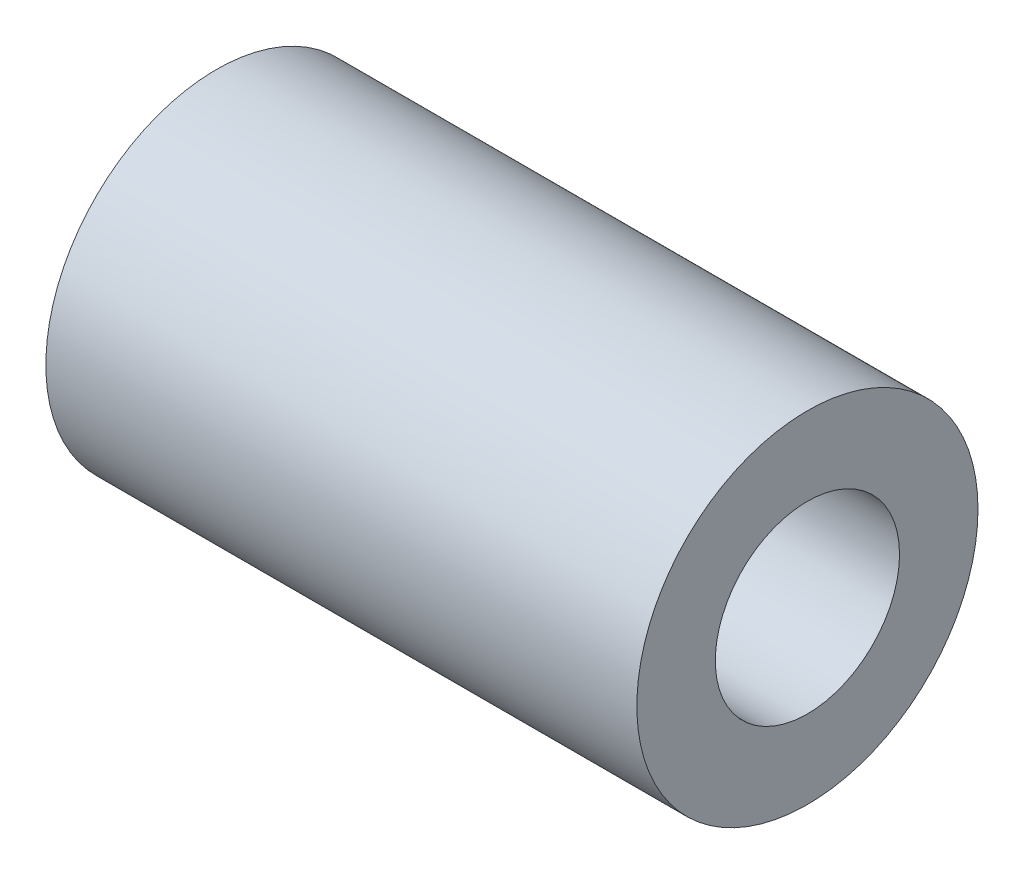
ISO-10303-21;
HEADER;
FILE_DESCRIPTION(('STEP AP214'),'2;1');
FILE_NAME('part.step','',(''),(''),'','','');
FILE_SCHEMA(('AUTOMOTIVE_DESIGN { 1 0 10303 214 1 1 1 1 }'));
ENDSEC;
DATA;
#1=APPLICATION_CONTEXT('core data for automotive mechanical design processes');
#2=APPLICATION_PROTOCOL_DEFINITION('international standard','automotive_design',2000,#1);
#3=PRODUCT_CONTEXT('',#1,'mechanical');
#4=PRODUCT('Part','Part','',(#3));
#5=PRODUCT_RELATED_PRODUCT_CATEGORY('part','',(#4));
#6=PRODUCT_DEFINITION_FORMATION('','',#4);
#7=PRODUCT_DEFINITION_CONTEXT('part definition',#1,'design');
#8=PRODUCT_DEFINITION('design','',#6,#7);
#9=PRODUCT_DEFINITION_SHAPE('','',#8);
#10=(LENGTH_UNIT() NAMED_UNIT(*) SI_UNIT(.MILLI.,.METRE.));
#11=(NAMED_UNIT(*) PLANE_ANGLE_UNIT() SI_UNIT($,.RADIAN.));
#12=(NAMED_UNIT(*) SI_UNIT($,.STERADIAN.) SOLID_ANGLE_UNIT());
#13=UNCERTAINTY_MEASURE_WITH_UNIT(LENGTH_MEASURE(1.E-05),#10,'distance_accuracy_value','');
#14=(GEOMETRIC_REPRESENTATION_CONTEXT(3) GLOBAL_UNCERTAINTY_ASSIGNED_CONTEXT((#13)) GLOBAL_UNIT_ASSIGNED_CONTEXT((#10,
#11,#12)) REPRESENTATION_CONTEXT('',''));
#15=CARTESIAN_POINT('',(0.,0.,0.));
#16=DIRECTION('',(0.,0.,1.));
#17=DIRECTION('',(1.,0.,0.));
#18=AXIS2_PLACEMENT_3D('',#15,#16,#17);
#19=CARTESIAN_POINT('',(-22.,0.,0.));
#20=DIRECTION('',(1.,0.,0.));
#21=DIRECTION('',(0.,0.,-1.));
#22=AXIS2_PLACEMENT_3D('',#19,#20,#21);
#23=CYLINDRICAL_SURFACE('',#22,6.35);
#24=CARTESIAN_POINT('',(-22.,0.,0.));
#25=DIRECTION('',(1.,0.,0.));
#26=DIRECTION('',(0.,0.,-1.));
#27=AXIS2_PLACEMENT_3D('',#24,#25,#26);
#28=CIRCLE('',#27,6.35);
#29=CARTESIAN_POINT('',(-22.,0.,-6.35));
#30=VERTEX_POINT('',#29);
#31=EDGE_CURVE('E10',#30,#30,#28,.T.);
#32=ORIENTED_EDGE('',*,*,#31,.T.);
#33=EDGE_LOOP('',(#32));
#34=FACE_BOUND('',#33,.T.);
#35=CARTESIAN_POINT('',(0.,0.,0.));
#36=DIRECTION('',(1.,0.,0.));
#37=DIRECTION('',(0.,0.,-1.));
#38=AXIS2_PLACEMENT_3D('',#35,#36,#37);
#39=CIRCLE('',#38,6.35);
#40=CARTESIAN_POINT('',(0.,0.,-6.35));
#41=VERTEX_POINT('',#40);
#42=EDGE_CURVE('E34',#41,#41,#39,.T.);
#43=ORIENTED_EDGE('',*,*,#42,.F.);
#44=EDGE_LOOP('',(#43));
#45=FACE_BOUND('',#44,.T.);
#46=ADVANCED_FACE('F31',(#34,#45),#23,.T.);
#47=CARTESIAN_POINT('',(-22.,0.,0.));
#48=DIRECTION('',(1.,0.,0.));
#49=DIRECTION('',(0.,0.,-1.));
#50=AXIS2_PLACEMENT_3D('',#47,#48,#49);
#51=PLANE('',#50);
#52=CARTESIAN_POINT('',(-22.,0.,0.));
#53=DIRECTION('',(1.,0.,0.));
#54=DIRECTION('',(0.,0.,-1.));
#55=AXIS2_PLACEMENT_3D('',#52,#53,#54);
#56=CIRCLE('',#55,3.429);
#57=CARTESIAN_POINT('',(-22.,0.,-3.429));
#58=VERTEX_POINT('',#57);
#59=EDGE_CURVE('E41',#58,#58,#56,.T.);
#60=ORIENTED_EDGE('',*,*,#59,.T.);
#61=EDGE_LOOP('',(#60));
#62=FACE_BOUND('',#61,.T.);
#63=ORIENTED_EDGE('',*,*,#31,.F.);
#64=EDGE_LOOP('',(#63));
#65=FACE_BOUND('',#64,.T.);
#66=ADVANCED_FACE('F49',(#62,#65),#51,.F.);
#67=CARTESIAN_POINT('',(0.,0.,0.));
#68=DIRECTION('',(1.,0.,0.));
#69=DIRECTION('',(0.,0.,-1.));
#70=AXIS2_PLACEMENT_3D('',#67,#68,#69);
#71=PLANE('',#70);
#72=CARTESIAN_POINT('',(0.,0.,0.));
#73=DIRECTION('',(1.,0.,0.));
#74=DIRECTION('',(0.,0.,-1.));
#75=AXIS2_PLACEMENT_3D('',#72,#73,#74);
#76=CIRCLE('',#75,3.429);
#77=CARTESIAN_POINT('',(0.,0.,-3.429));
#78=VERTEX_POINT('',#77);
#79=EDGE_CURVE('E43',#78,#78,#76,.T.);
#80=ORIENTED_EDGE('',*,*,#79,.F.);
#81=EDGE_LOOP('',(#80));
#82=FACE_BOUND('',#81,.T.);
#83=ORIENTED_EDGE('',*,*,#42,.T.);
#84=EDGE_LOOP('',(#83));
#85=FACE_BOUND('',#84,.T.);
#86=ADVANCED_FACE('F55',(#82,#85),#71,.T.);
#87=CARTESIAN_POINT('',(-22.,0.,0.));
#88=DIRECTION('',(1.,0.,0.));
#89=DIRECTION('',(0.,0.,-1.));
#90=AXIS2_PLACEMENT_3D('',#87,#88,#89);
#91=CYLINDRICAL_SURFACE('',#90,3.429);
#92=ORIENTED_EDGE('',*,*,#59,.F.);
#93=EDGE_LOOP('',(#92));
#94=FACE_BOUND('',#93,.T.);
#95=ORIENTED_EDGE('',*,*,#79,.T.);
#96=EDGE_LOOP('',(#95));
#97=FACE_BOUND('',#96,.T.);
#98=ADVANCED_FACE('F52',(#94,#97),#91,.F.);
#99=CLOSED_SHELL('',(#46,#66,#86,#98));
#100=MANIFOLD_SOLID_BREP('B2',#99);
#101=ADVANCED_BREP_SHAPE_REPRESENTATION('',(#18,#100),#14);
#102=SHAPE_DEFINITION_REPRESENTATION(#9,#101);
ENDSEC;
END-ISO-10303-21;
